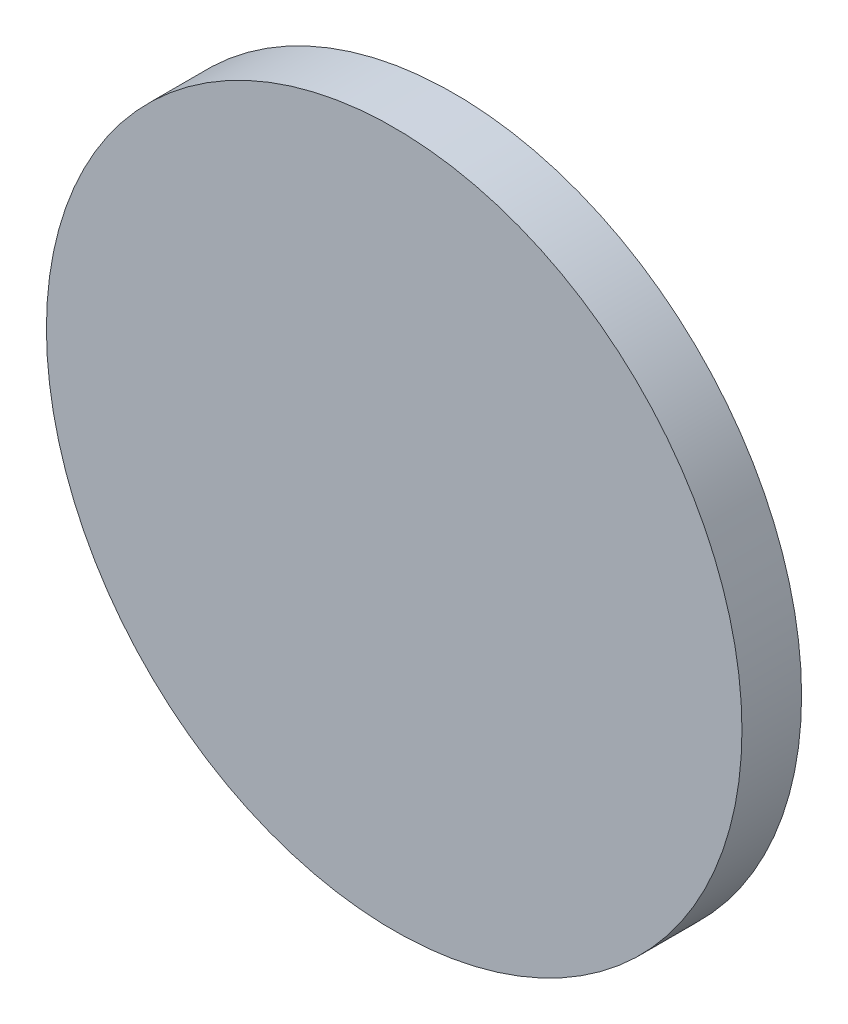
ISO-10303-21;
HEADER;
FILE_DESCRIPTION(('STEP AP214'),'2;1');
FILE_NAME('part.step','',(''),(''),'','','');
FILE_SCHEMA(('AUTOMOTIVE_DESIGN { 1 0 10303 214 1 1 1 1 }'));
ENDSEC;
DATA;
#1=APPLICATION_CONTEXT('core data for automotive mechanical design processes');
#2=APPLICATION_PROTOCOL_DEFINITION('international standard','automotive_design',2000,#1);
#3=PRODUCT_CONTEXT('',#1,'mechanical');
#4=PRODUCT('Part','Part','',(#3));
#5=PRODUCT_RELATED_PRODUCT_CATEGORY('part','',(#4));
#6=PRODUCT_DEFINITION_FORMATION('','',#4);
#7=PRODUCT_DEFINITION_CONTEXT('part definition',#1,'design');
#8=PRODUCT_DEFINITION('design','',#6,#7);
#9=PRODUCT_DEFINITION_SHAPE('','',#8);
#10=(LENGTH_UNIT() NAMED_UNIT(*) SI_UNIT(.MILLI.,.METRE.));
#11=(NAMED_UNIT(*) PLANE_ANGLE_UNIT() SI_UNIT($,.RADIAN.));
#12=(NAMED_UNIT(*) SI_UNIT($,.STERADIAN.) SOLID_ANGLE_UNIT());
#13=UNCERTAINTY_MEASURE_WITH_UNIT(LENGTH_MEASURE(1.E-05),#10,'distance_accuracy_value','');
#14=(GEOMETRIC_REPRESENTATION_CONTEXT(3) GLOBAL_UNCERTAINTY_ASSIGNED_CONTEXT((#13)) GLOBAL_UNIT_ASSIGNED_CONTEXT((#10,
#11,#12)) REPRESENTATION_CONTEXT('',''));
#15=CARTESIAN_POINT('',(0.,0.,0.));
#16=DIRECTION('',(0.,0.,1.));
#17=DIRECTION('',(1.,0.,0.));
#18=AXIS2_PLACEMENT_3D('',#15,#16,#17);
#19=CARTESIAN_POINT('',(11.90008,10.400000014875,0.76487));
#20=DIRECTION('',(0.,0.,-1.));
#21=DIRECTION('',(-1.,0.,0.));
#22=AXIS2_PLACEMENT_3D('',#19,#20,#21);
#23=PLANE('',#22);
#24=CARTESIAN_POINT('',(11.90008,10.400000014875,0.76487));
#25=DIRECTION('',(0.,0.,1.));
#26=DIRECTION('',(1.,0.,0.));
#27=AXIS2_PLACEMENT_3D('',#24,#25,#26);
#28=CIRCLE('',#27,0.200024667);
#29=CARTESIAN_POINT('',(12.100104667,10.400000014875,0.76487));
#30=VERTEX_POINT('',#29);
#31=EDGE_CURVE('E18',#30,#30,#28,.T.);
#32=ORIENTED_EDGE('',*,*,#31,.F.);
#33=EDGE_LOOP('',(#32));
#34=FACE_BOUND('',#33,.T.);
#35=ADVANCED_FACE('F15',(#34),#23,.T.);
#36=CARTESIAN_POINT('',(11.90008,10.400000014875,0.76487));
#37=DIRECTION('',(0.,0.,1.));
#38=DIRECTION('',(1.,0.,0.));
#39=AXIS2_PLACEMENT_3D('',#36,#37,#38);
#40=CYLINDRICAL_SURFACE('',#39,0.200024667);
#41=CARTESIAN_POINT('',(11.90008,10.400000014875,0.79916));
#42=DIRECTION('',(0.,0.,1.));
#43=DIRECTION('',(1.,0.,0.));
#44=AXIS2_PLACEMENT_3D('',#41,#42,#43);
#45=CIRCLE('',#44,0.200024667);
#46=CARTESIAN_POINT('',(12.100104667,10.400000014875,0.79916));
#47=VERTEX_POINT('',#46);
#48=EDGE_CURVE('E10',#47,#47,#45,.T.);
#49=ORIENTED_EDGE('',*,*,#48,.F.);
#50=EDGE_LOOP('',(#49));
#51=FACE_BOUND('',#50,.T.);
#52=ORIENTED_EDGE('',*,*,#31,.T.);
#53=EDGE_LOOP('',(#52));
#54=FACE_BOUND('',#53,.T.);
#55=ADVANCED_FACE('F27',(#51,#54),#40,.T.);
#56=CARTESIAN_POINT('',(11.90008,10.400000014875,0.79916));
#57=DIRECTION('',(0.,0.,1.));
#58=DIRECTION('',(1.,0.,0.));
#59=AXIS2_PLACEMENT_3D('',#56,#57,#58);
#60=PLANE('',#59);
#61=ORIENTED_EDGE('',*,*,#48,.T.);
#62=EDGE_LOOP('',(#61));
#63=FACE_BOUND('',#62,.T.);
#64=ADVANCED_FACE('F34',(#63),#60,.T.);
#65=CLOSED_SHELL('',(#35,#55,#64));
#66=MANIFOLD_SOLID_BREP('B1',#65);
#67=ADVANCED_BREP_SHAPE_REPRESENTATION('',(#18,#66),#14);
#68=SHAPE_DEFINITION_REPRESENTATION(#9,#67);
ENDSEC;
END-ISO-10303-21;
